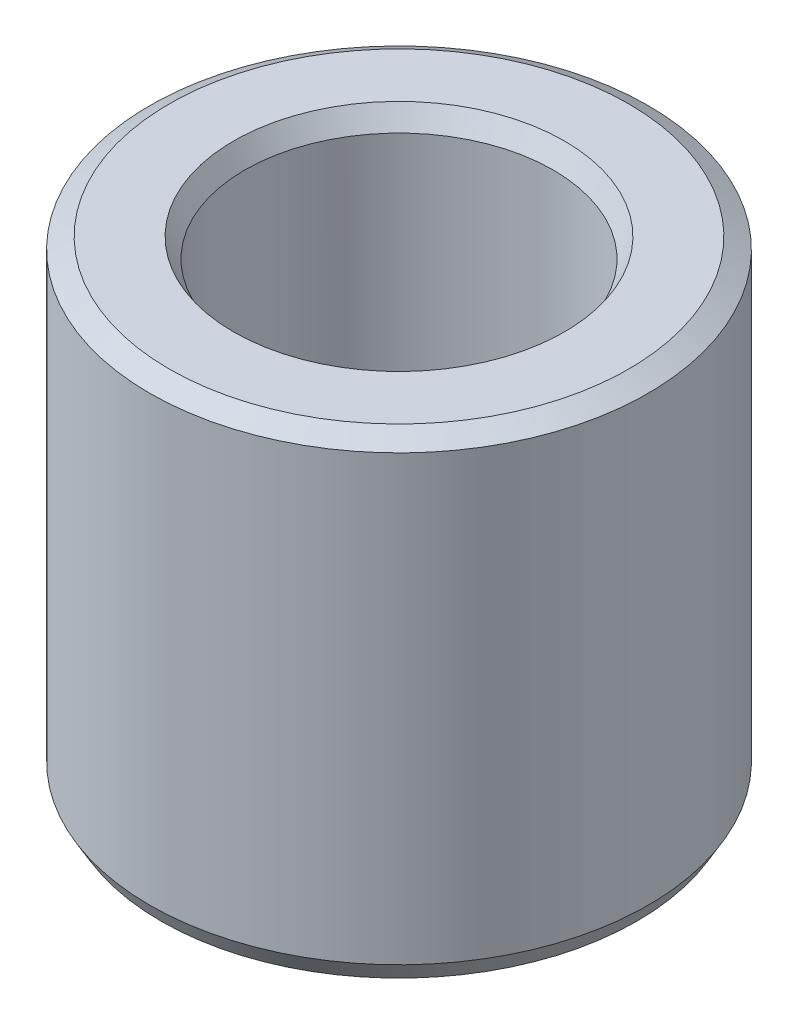
ISO-10303-21;
HEADER;
FILE_DESCRIPTION(('STEP AP214'),'2;1');
FILE_NAME('part.step','',(''),(''),'','','');
FILE_SCHEMA(('AUTOMOTIVE_DESIGN { 1 0 10303 214 1 1 1 1 }'));
ENDSEC;
DATA;
#1=APPLICATION_CONTEXT('core data for automotive mechanical design processes');
#2=APPLICATION_PROTOCOL_DEFINITION('international standard','automotive_design',2000,#1);
#3=PRODUCT_CONTEXT('',#1,'mechanical');
#4=PRODUCT('Part','Part','',(#3));
#5=PRODUCT_RELATED_PRODUCT_CATEGORY('part','',(#4));
#6=PRODUCT_DEFINITION_FORMATION('','',#4);
#7=PRODUCT_DEFINITION_CONTEXT('part definition',#1,'design');
#8=PRODUCT_DEFINITION('design','',#6,#7);
#9=PRODUCT_DEFINITION_SHAPE('','',#8);
#10=(LENGTH_UNIT() NAMED_UNIT(*) SI_UNIT(.MILLI.,.METRE.));
#11=(NAMED_UNIT(*) PLANE_ANGLE_UNIT() SI_UNIT($,.RADIAN.));
#12=(NAMED_UNIT(*) SI_UNIT($,.STERADIAN.) SOLID_ANGLE_UNIT());
#13=UNCERTAINTY_MEASURE_WITH_UNIT(LENGTH_MEASURE(1.E-05),#10,'distance_accuracy_value','');
#14=(GEOMETRIC_REPRESENTATION_CONTEXT(3) GLOBAL_UNCERTAINTY_ASSIGNED_CONTEXT((#13)) GLOBAL_UNIT_ASSIGNED_CONTEXT((#10,
#11,#12)) REPRESENTATION_CONTEXT('',''));
#15=CARTESIAN_POINT('',(0.,0.,0.));
#16=DIRECTION('',(0.,0.,1.));
#17=DIRECTION('',(1.,0.,0.));
#18=AXIS2_PLACEMENT_3D('',#15,#16,#17);
#19=CARTESIAN_POINT('',(0.,61.8248316753752,0.));
#20=DIRECTION('',(0.,-1.,0.));
#21=DIRECTION('',(0.,0.,-1.));
#22=AXIS2_PLACEMENT_3D('',#19,#20,#21);
#23=CYLINDRICAL_SURFACE('',#22,32.5);
#24=CARTESIAN_POINT('',(0.,2.54097205210782,0.));
#25=DIRECTION('',(0.,1.,0.));
#26=DIRECTION('',(0.,0.,1.));
#27=AXIS2_PLACEMENT_3D('',#24,#25,#26);
#28=CIRCLE('',#27,32.5);
#29=CARTESIAN_POINT('',(0.,2.54097205210781,-32.5));
#30=VERTEX_POINT('',#29);
#31=EDGE_CURVE('E10',#30,#30,#28,.T.);
#32=CARTESIAN_POINT('',(0.,60.3578007770875,0.));
#33=DIRECTION('',(0.,1.,0.));
#34=DIRECTION('',(0.,0.,1.));
#35=AXIS2_PLACEMENT_3D('',#32,#33,#34);
#36=CIRCLE('',#35,32.5);
#37=CARTESIAN_POINT('',(0.,60.3578007770875,-32.5));
#38=VERTEX_POINT('',#37);
#39=EDGE_CURVE('E50',#38,#38,#36,.F.);
#40=CARTESIAN_POINT('',(0.,2.54097205210781,-32.5));
#41=CARTESIAN_POINT('',(0.,3.14323068465968,-32.5));
#42=CARTESIAN_POINT('',(0.,3.74548931721156,-32.5));
#43=CARTESIAN_POINT('',(0.,4.9500065823153,-32.5));
#44=CARTESIAN_POINT('',(0.,5.55226521486717,-32.5));
#45=CARTESIAN_POINT('',(0.,6.75678247997092,-32.5));
#46=CARTESIAN_POINT('',(0.,7.35904111252279,-32.5));
#47=CARTESIAN_POINT('',(0.,8.56355837762653,-32.5));
#48=CARTESIAN_POINT('',(0.,9.1658170101784,-32.5));
#49=CARTESIAN_POINT('',(0.,10.3703342752821,-32.5));
#50=CARTESIAN_POINT('',(0.,10.972592907834,-32.5));
#51=CARTESIAN_POINT('',(0.,12.1771101729378,-32.5));
#52=CARTESIAN_POINT('',(0.,12.7793688054896,-32.5));
#53=CARTESIAN_POINT('',(0.,13.9838860705934,-32.5));
#54=CARTESIAN_POINT('',(0.,14.5861447031452,-32.5));
#55=CARTESIAN_POINT('',(0.,15.790661968249,-32.5));
#56=CARTESIAN_POINT('',(0.,16.3929206008009,-32.5));
#57=CARTESIAN_POINT('',(0.,17.5974378659046,-32.5));
#58=CARTESIAN_POINT('',(0.,18.1996964984565,-32.5));
#59=CARTESIAN_POINT('',(0.,19.4042137635602,-32.5));
#60=CARTESIAN_POINT('',(0.,20.0064723961121,-32.5));
#61=CARTESIAN_POINT('',(0.,21.2109896612158,-32.5));
#62=CARTESIAN_POINT('',(0.,21.8132482937677,-32.5));
#63=CARTESIAN_POINT('',(0.,23.0177655588715,-32.5));
#64=CARTESIAN_POINT('',(0.,23.6200241914233,-32.5));
#65=CARTESIAN_POINT('',(0.,24.8245414565271,-32.5));
#66=CARTESIAN_POINT('',(0.,25.4268000890789,-32.5));
#67=CARTESIAN_POINT('',(0.,26.6313173541827,-32.5));
#68=CARTESIAN_POINT('',(0.,27.2335759867346,-32.5));
#69=CARTESIAN_POINT('',(0.,28.4380932518383,-32.5));
#70=CARTESIAN_POINT('',(0.,29.0403518843902,-32.5));
#71=CARTESIAN_POINT('',(0.,30.2448691494939,-32.5));
#72=CARTESIAN_POINT('',(0.,30.8471277820458,-32.5));
#73=CARTESIAN_POINT('',(0.,32.0516450471495,-32.5));
#74=CARTESIAN_POINT('',(0.,32.6539036797014,-32.5));
#75=CARTESIAN_POINT('',(0.,33.8584209448051,-32.5));
#76=CARTESIAN_POINT('',(0.,34.460679577357,-32.5));
#77=CARTESIAN_POINT('',(0.,35.6651968424608,-32.5));
#78=CARTESIAN_POINT('',(0.,36.2674554750126,-32.5));
#79=CARTESIAN_POINT('',(0.,37.4719727401164,-32.5));
#80=CARTESIAN_POINT('',(0.,38.0742313726682,-32.5));
#81=CARTESIAN_POINT('',(0.,39.278748637772,-32.5));
#82=CARTESIAN_POINT('',(0.,39.8810072703239,-32.5));
#83=CARTESIAN_POINT('',(0.,41.0855245354276,-32.5));
#84=CARTESIAN_POINT('',(0.,41.6877831679795,-32.5));
#85=CARTESIAN_POINT('',(0.,42.8923004330832,-32.5));
#86=CARTESIAN_POINT('',(0.,43.4945590656351,-32.5));
#87=CARTESIAN_POINT('',(0.,44.6990763307388,-32.5));
#88=CARTESIAN_POINT('',(0.,45.3013349632907,-32.5));
#89=CARTESIAN_POINT('',(0.,46.5058522283945,-32.5));
#90=CARTESIAN_POINT('',(0.,47.1081108609463,-32.5));
#91=CARTESIAN_POINT('',(0.,48.3126281260501,-32.5));
#92=CARTESIAN_POINT('',(0.,48.9148867586019,-32.5));
#93=CARTESIAN_POINT('',(0.,50.1194040237057,-32.5));
#94=CARTESIAN_POINT('',(0.,50.7216626562575,-32.5));
#95=CARTESIAN_POINT('',(0.,51.9261799213613,-32.5));
#96=CARTESIAN_POINT('',(0.,52.5284385539132,-32.5));
#97=CARTESIAN_POINT('',(0.,53.7329558190169,-32.5));
#98=CARTESIAN_POINT('',(0.,54.3352144515688,-32.5));
#99=CARTESIAN_POINT('',(0.,55.5397317166725,-32.5));
#100=CARTESIAN_POINT('',(0.,56.1419903492244,-32.5));
#101=CARTESIAN_POINT('',(0.,57.3465076143281,-32.5));
#102=CARTESIAN_POINT('',(0.,57.94876624688,-32.5));
#103=CARTESIAN_POINT('',(0.,59.1532835119838,-32.5));
#104=CARTESIAN_POINT('',(0.,59.7555421445356,-32.5));
#105=CARTESIAN_POINT('',(0.,60.3578007770875,-32.5));
#106=B_SPLINE_CURVE_WITH_KNOTS('',3,(#40,#41,#42,#43,#44,#45,#46,#47,#48,#49,#50,#51,#52,#53,
#54,#55,#56,#57,#58,#59,#60,#61,#62,#63,#64,#65,#66,#67,#68,#69,#70,#71,#72,#73,#74,#75,#76,#77,
#78,#79,#80,#81,#82,#83,#84,#85,#86,#87,#88,#89,#90,#91,#92,#93,#94,#95,#96,#97,#98,#99,#100,
#101,#102,#103,#104,#105),.UNSPECIFIED.,.F.,.F.,(4,2,2,2,2,2,2,2,2,2,2,2,2,2,2,2,2,2,2,2,2,2,2,
2,2,2,2,2,2,2,2,2,4),(0.,1.80677589765561,3.61355179531123,5.42032769296685,7.22710359062246,
9.03387948827808,10.8406553859337,12.6474312835893,14.4542071812449,16.2609830789005,
18.0677589765562,19.8745348742118,21.6813107718674,23.488086669523,25.2948625671786,
27.1016384648342,28.9084143624898,30.7151902601455,32.5219661578011,34.3287420554567,
36.1355179531123,37.9422938507679,39.7490697484235,41.5558456460791,43.3626215437348,
45.1693974413904,46.976173339046,48.7829492367016,50.5897251343572,52.3965010320128,
54.2032769296684,56.0100528273241,57.8168287249797),.UNSPECIFIED.);
#107=EDGE_CURVE('BSEAM39',#30,#38,#106,.T.);
#108=ORIENTED_EDGE('',*,*,#31,.T.);
#109=ORIENTED_EDGE('',*,*,#39,.T.);
#110=ORIENTED_EDGE('',*,*,#107,.T.);
#111=ORIENTED_EDGE('',*,*,#107,.F.);
#112=EDGE_LOOP('',(#108,#110,#109,#111));
#113=FACE_BOUND('',#112,.T.);
#114=ADVANCED_FACE('F39',(#113),#23,.T.);
#115=CARTESIAN_POINT('',(0.,61.8248316753752,0.));
#116=DIRECTION('',(0.,1.,0.));
#117=DIRECTION('',(0.,0.,1.));
#118=AXIS2_PLACEMENT_3D('',#115,#116,#117);
#119=PLANE('',#118);
#120=CARTESIAN_POINT('',(0.,61.8248316753752,0.));
#121=DIRECTION('',(0.,1.,0.));
#122=DIRECTION('',(0.,0.,1.));
#123=AXIS2_PLACEMENT_3D('',#120,#121,#122);
#124=CIRCLE('',#123,21.574494656585);
#125=CARTESIAN_POINT('',(0.,61.8248316753752,21.574494656585));
#126=VERTEX_POINT('',#125);
#127=EDGE_CURVE('E58',#126,#126,#124,.F.);
#128=ORIENTED_EDGE('',*,*,#127,.T.);
#129=EDGE_LOOP('',(#128));
#130=FACE_BOUND('',#129,.T.);
#131=CARTESIAN_POINT('',(0.,61.8248316753752,0.));
#132=DIRECTION('',(0.,1.,0.));
#133=DIRECTION('',(0.,0.,1.));
#134=AXIS2_PLACEMENT_3D('',#131,#132,#133);
#135=CIRCLE('',#134,29.9590279478924);
#136=CARTESIAN_POINT('',(0.,61.8248316753752,29.9590279478924));
#137=VERTEX_POINT('',#136);
#138=EDGE_CURVE('E61',#137,#137,#135,.T.);
#139=ORIENTED_EDGE('',*,*,#138,.T.);
#140=EDGE_LOOP('',(#139));
#141=FACE_BOUND('',#140,.T.);
#142=ADVANCED_FACE('F88',(#130,#141),#119,.T.);
#143=CARTESIAN_POINT('',(0.,0.,0.));
#144=DIRECTION('',(0.,1.,0.));
#145=DIRECTION('',(0.,0.,1.));
#146=AXIS2_PLACEMENT_3D('',#143,#144,#145);
#147=PLANE('',#146);
#148=CARTESIAN_POINT('',(0.,0.,0.));
#149=DIRECTION('',(0.,1.,0.));
#150=DIRECTION('',(0.,0.,1.));
#151=AXIS2_PLACEMENT_3D('',#148,#149,#150);
#152=CIRCLE('',#151,22.6484358104049);
#153=CARTESIAN_POINT('',(0.,0.,22.6484358104049));
#154=VERTEX_POINT('',#153);
#155=EDGE_CURVE('E51',#154,#154,#152,.T.);
#156=ORIENTED_EDGE('',*,*,#155,.T.);
#157=EDGE_LOOP('',(#156));
#158=FACE_BOUND('',#157,.T.);
#159=CARTESIAN_POINT('',(0.,0.,0.));
#160=DIRECTION('',(0.,1.,0.));
#161=DIRECTION('',(0.,0.,1.));
#162=AXIS2_PLACEMENT_3D('',#159,#160,#161);
#163=CIRCLE('',#162,31.0329691017122);
#164=CARTESIAN_POINT('',(0.,0.,31.0329691017122));
#165=VERTEX_POINT('',#164);
#166=EDGE_CURVE('E54',#165,#165,#163,.F.);
#167=ORIENTED_EDGE('',*,*,#166,.T.);
#168=EDGE_LOOP('',(#167));
#169=FACE_BOUND('',#168,.T.);
#170=ADVANCED_FACE('F83',(#158,#169),#147,.F.);
#171=CARTESIAN_POINT('',(0.,61.8248316753752,0.));
#172=DIRECTION('',(0.,-1.,0.));
#173=DIRECTION('',(0.,0.,-1.));
#174=AXIS2_PLACEMENT_3D('',#171,#172,#173);
#175=CYLINDRICAL_SURFACE('',#174,20.1074637582972);
#176=CARTESIAN_POINT('',(0.,59.2838596232674,0.));
#177=DIRECTION('',(0.,1.,0.));
#178=DIRECTION('',(0.,0.,1.));
#179=AXIS2_PLACEMENT_3D('',#176,#177,#178);
#180=CIRCLE('',#179,20.1074637582972);
#181=CARTESIAN_POINT('',(0.,59.2838596232674,-20.1074637582972));
#182=VERTEX_POINT('',#181);
#183=EDGE_CURVE('E67',#182,#182,#180,.T.);
#184=CARTESIAN_POINT('',(0.,1.46703089828769,0.));
#185=DIRECTION('',(0.,1.,0.));
#186=DIRECTION('',(0.,0.,1.));
#187=AXIS2_PLACEMENT_3D('',#184,#185,#186);
#188=CIRCLE('',#187,20.1074637582972);
#189=CARTESIAN_POINT('',(0.,1.46703089828768,-20.1074637582972));
#190=VERTEX_POINT('',#189);
#191=EDGE_CURVE('E69',#190,#190,#188,.F.);
#192=CARTESIAN_POINT('',(0.,59.2838596232674,-20.1074637582972));
#193=CARTESIAN_POINT('',(0.,58.6816009907155,-20.1074637582972));
#194=CARTESIAN_POINT('',(0.,58.0793423581636,-20.1074637582972));
#195=CARTESIAN_POINT('',(0.,56.8748250930599,-20.1074637582972));
#196=CARTESIAN_POINT('',(0.,56.272566460508,-20.1074637582972));
#197=CARTESIAN_POINT('',(0.,55.0680491954043,-20.1074637582972));
#198=CARTESIAN_POINT('',(0.,54.4657905628524,-20.1074637582972));
#199=CARTESIAN_POINT('',(0.,53.2612732977486,-20.1074637582972));
#200=CARTESIAN_POINT('',(0.,52.6590146651968,-20.1074637582972));
#201=CARTESIAN_POINT('',(0.,51.454497400093,-20.1074637582972));
#202=CARTESIAN_POINT('',(0.,50.8522387675412,-20.1074637582972));
#203=CARTESIAN_POINT('',(0.,49.6477215024374,-20.1074637582972));
#204=CARTESIAN_POINT('',(0.,49.0454628698855,-20.1074637582972));
#205=CARTESIAN_POINT('',(0.,47.8409456047818,-20.1074637582972));
#206=CARTESIAN_POINT('',(0.,47.2386869722299,-20.1074637582972));
#207=CARTESIAN_POINT('',(0.,46.0341697071262,-20.1074637582972));
#208=CARTESIAN_POINT('',(0.,45.4319110745743,-20.1074637582972));
#209=CARTESIAN_POINT('',(0.,44.2273938094706,-20.1074637582972));
#210=CARTESIAN_POINT('',(0.,43.6251351769187,-20.1074637582972));
#211=CARTESIAN_POINT('',(0.,42.420617911815,-20.1074637582972));
#212=CARTESIAN_POINT('',(0.,41.8183592792631,-20.1074637582972));
#213=CARTESIAN_POINT('',(0.,40.6138420141593,-20.1074637582972));
#214=CARTESIAN_POINT('',(0.,40.0115833816075,-20.1074637582972));
#215=CARTESIAN_POINT('',(0.,38.8070661165037,-20.1074637582972));
#216=CARTESIAN_POINT('',(0.,38.2048074839519,-20.1074637582972));
#217=CARTESIAN_POINT('',(0.,37.0002902188481,-20.1074637582972));
#218=CARTESIAN_POINT('',(0.,36.3980315862962,-20.1074637582972));
#219=CARTESIAN_POINT('',(0.,35.1935143211925,-20.1074637582972));
#220=CARTESIAN_POINT('',(0.,34.5912556886406,-20.1074637582972));
#221=CARTESIAN_POINT('',(0.,33.3867384235369,-20.1074637582972));
#222=CARTESIAN_POINT('',(0.,32.784479790985,-20.1074637582972));
#223=CARTESIAN_POINT('',(0.,31.5799625258813,-20.1074637582972));
#224=CARTESIAN_POINT('',(0.,30.9777038933294,-20.1074637582972));
#225=CARTESIAN_POINT('',(0.,29.7731866282257,-20.1074637582972));
#226=CARTESIAN_POINT('',(0.,29.1709279956738,-20.1074637582972));
#227=CARTESIAN_POINT('',(0.,27.96641073057,-20.1074637582972));
#228=CARTESIAN_POINT('',(0.,27.3641520980182,-20.1074637582972));
#229=CARTESIAN_POINT('',(0.,26.1596348329144,-20.1074637582972));
#230=CARTESIAN_POINT('',(0.,25.5573762003625,-20.1074637582972));
#231=CARTESIAN_POINT('',(0.,24.3528589352588,-20.1074637582972));
#232=CARTESIAN_POINT('',(0.,23.7506003027069,-20.1074637582972));
#233=CARTESIAN_POINT('',(0.,22.5460830376032,-20.1074637582972));
#234=CARTESIAN_POINT('',(0.,21.9438244050513,-20.1074637582972));
#235=CARTESIAN_POINT('',(0.,20.7393071399476,-20.1074637582972));
#236=CARTESIAN_POINT('',(0.,20.1370485073957,-20.1074637582972));
#237=CARTESIAN_POINT('',(0.,18.932531242292,-20.1074637582972));
#238=CARTESIAN_POINT('',(0.,18.3302726097401,-20.1074637582972));
#239=CARTESIAN_POINT('',(0.,17.1257553446363,-20.1074637582972));
#240=CARTESIAN_POINT('',(0.,16.5234967120845,-20.1074637582972));
#241=CARTESIAN_POINT('',(0.,15.3189794469807,-20.1074637582972));
#242=CARTESIAN_POINT('',(0.,14.7167208144289,-20.1074637582972));
#243=CARTESIAN_POINT('',(0.,13.5122035493251,-20.1074637582972));
#244=CARTESIAN_POINT('',(0.,12.9099449167732,-20.1074637582972));
#245=CARTESIAN_POINT('',(0.,11.7054276516695,-20.1074637582972));
#246=CARTESIAN_POINT('',(0.,11.1031690191176,-20.1074637582972));
#247=CARTESIAN_POINT('',(0.,9.89865175401388,-20.1074637582972));
#248=CARTESIAN_POINT('',(0.,9.29639312146201,-20.1074637582972));
#249=CARTESIAN_POINT('',(0.,8.09187585635827,-20.1074637582972));
#250=CARTESIAN_POINT('',(0.,7.4896172238064,-20.1074637582972));
#251=CARTESIAN_POINT('',(0.,6.28509995870266,-20.1074637582972));
#252=CARTESIAN_POINT('',(0.,5.68284132615079,-20.1074637582972));
#253=CARTESIAN_POINT('',(0.,4.47832406104704,-20.1074637582972));
#254=CARTESIAN_POINT('',(0.,3.87606542849517,-20.1074637582972));
#255=CARTESIAN_POINT('',(0.,2.67154816339142,-20.1074637582972));
#256=CARTESIAN_POINT('',(0.,2.06928953083955,-20.1074637582972));
#257=CARTESIAN_POINT('',(0.,1.46703089828768,-20.1074637582972));
#258=B_SPLINE_CURVE_WITH_KNOTS('',3,(#192,#193,#194,#195,#196,#197,#198,#199,#200,#201,#202,
#203,#204,#205,#206,#207,#208,#209,#210,#211,#212,#213,#214,#215,#216,#217,#218,#219,#220,#221,
#222,#223,#224,#225,#226,#227,#228,#229,#230,#231,#232,#233,#234,#235,#236,#237,#238,#239,#240,
#241,#242,#243,#244,#245,#246,#247,#248,#249,#250,#251,#252,#253,#254,#255,#256,#257),
.UNSPECIFIED.,.F.,.F.,(4,2,2,2,2,2,2,2,2,2,2,2,2,2,2,2,2,2,2,2,2,2,2,2,2,2,2,2,2,2,2,2,4),(0.,
1.80677589765561,3.61355179531123,5.42032769296684,7.22710359062246,9.03387948827807,
10.8406553859337,12.6474312835893,14.4542071812449,16.2609830789005,18.0677589765561,
19.8745348742118,21.6813107718674,23.488086669523,25.2948625671786,27.1016384648342,
28.9084143624898,30.7151902601455,32.5219661578011,34.3287420554567,36.1355179531123,
37.9422938507679,39.7490697484235,41.5558456460791,43.3626215437348,45.1693974413904,
46.976173339046,48.7829492367016,50.5897251343572,52.3965010320128,54.2032769296684,
56.0100528273241,57.8168287249797),.UNSPECIFIED.);
#259=EDGE_CURVE('BSEAM71',#182,#190,#258,.T.);
#260=ORIENTED_EDGE('',*,*,#183,.T.);
#261=ORIENTED_EDGE('',*,*,#191,.T.);
#262=ORIENTED_EDGE('',*,*,#259,.T.);
#263=ORIENTED_EDGE('',*,*,#259,.F.);
#264=EDGE_LOOP('',(#260,#262,#261,#263));
#265=FACE_BOUND('',#264,.T.);
#266=ADVANCED_FACE('F71',(#265),#175,.F.);
#267=CARTESIAN_POINT('',(0.,59.2838596232674,0.));
#268=DIRECTION('',(0.,1.,0.));
#269=DIRECTION('',(0.,0.,1.));
#270=AXIS2_PLACEMENT_3D('',#267,#268,#269);
#271=CONICAL_SURFACE('',#270,20.1074637582972,0.523598775598304);
#272=ORIENTED_EDGE('',*,*,#127,.F.);
#273=EDGE_LOOP('',(#272));
#274=FACE_BOUND('',#273,.T.);
#275=ORIENTED_EDGE('',*,*,#183,.F.);
#276=EDGE_LOOP('',(#275));
#277=FACE_BOUND('',#276,.T.);
#278=ADVANCED_FACE('F77',(#274,#277),#271,.F.);
#279=CARTESIAN_POINT('',(0.,0.,0.));
#280=DIRECTION('',(0.,-1.,0.));
#281=DIRECTION('',(0.,0.,-1.));
#282=AXIS2_PLACEMENT_3D('',#279,#280,#281);
#283=CONICAL_SURFACE('',#282,22.6484358104049,1.04719755119659);
#284=ORIENTED_EDGE('',*,*,#191,.F.);
#285=EDGE_LOOP('',(#284));
#286=FACE_BOUND('',#285,.T.);
#287=ORIENTED_EDGE('',*,*,#155,.F.);
#288=EDGE_LOOP('',(#287));
#289=FACE_BOUND('',#288,.T.);
#290=ADVANCED_FACE('F73',(#286,#289),#283,.F.);
#291=CARTESIAN_POINT('',(0.,2.54097205210782,0.));
#292=DIRECTION('',(0.,1.,0.));
#293=DIRECTION('',(0.,0.,1.));
#294=AXIS2_PLACEMENT_3D('',#291,#292,#293);
#295=CONICAL_SURFACE('',#294,32.5,0.523598775598304);
#296=ORIENTED_EDGE('',*,*,#166,.F.);
#297=EDGE_LOOP('',(#296));
#298=FACE_BOUND('',#297,.T.);
#299=ORIENTED_EDGE('',*,*,#31,.F.);
#300=EDGE_LOOP('',(#299));
#301=FACE_BOUND('',#300,.T.);
#302=ADVANCED_FACE('F76',(#298,#301),#295,.T.);
#303=CARTESIAN_POINT('',(0.,61.8248316753752,0.));
#304=DIRECTION('',(0.,-1.,0.));
#305=DIRECTION('',(0.,0.,-1.));
#306=AXIS2_PLACEMENT_3D('',#303,#304,#305);
#307=CONICAL_SURFACE('',#306,29.9590279478924,1.04719755119659);
#308=ORIENTED_EDGE('',*,*,#39,.F.);
#309=EDGE_LOOP('',(#308));
#310=FACE_BOUND('',#309,.T.);
#311=ORIENTED_EDGE('',*,*,#138,.F.);
#312=EDGE_LOOP('',(#311));
#313=FACE_BOUND('',#312,.T.);
#314=ADVANCED_FACE('F45',(#310,#313),#307,.T.);
#315=CLOSED_SHELL('',(#114,#142,#170,#266,#278,#290,#302,#314));
#316=MANIFOLD_SOLID_BREP('B2',#315);
#317=ADVANCED_BREP_SHAPE_REPRESENTATION('',(#18,#316),#14);
#318=SHAPE_DEFINITION_REPRESENTATION(#9,#317);
ENDSEC;
END-ISO-10303-21;
